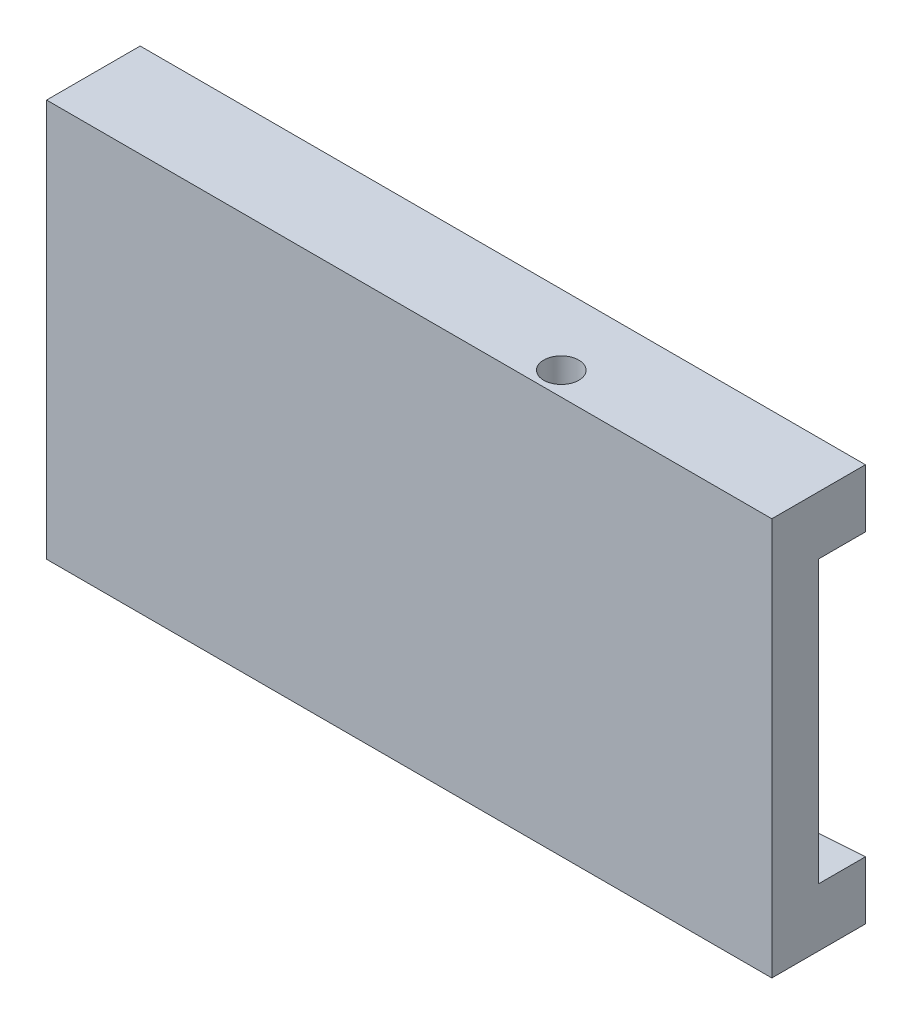
ISO-10303-21;
HEADER;
FILE_DESCRIPTION(('STEP AP214'),'2;1');
FILE_NAME('part.step','',(''),(''),'','','');
FILE_SCHEMA(('AUTOMOTIVE_DESIGN { 1 0 10303 214 1 1 1 1 }'));
ENDSEC;
DATA;
#1=APPLICATION_CONTEXT('core data for automotive mechanical design processes');
#2=APPLICATION_PROTOCOL_DEFINITION('international standard','automotive_design',2000,#1);
#3=PRODUCT_CONTEXT('',#1,'mechanical');
#4=PRODUCT('Part','Part','',(#3));
#5=PRODUCT_RELATED_PRODUCT_CATEGORY('part','',(#4));
#6=PRODUCT_DEFINITION_FORMATION('','',#4);
#7=PRODUCT_DEFINITION_CONTEXT('part definition',#1,'design');
#8=PRODUCT_DEFINITION('design','',#6,#7);
#9=PRODUCT_DEFINITION_SHAPE('','',#8);
#10=(LENGTH_UNIT() NAMED_UNIT(*) SI_UNIT(.MILLI.,.METRE.));
#11=(NAMED_UNIT(*) PLANE_ANGLE_UNIT() SI_UNIT($,.RADIAN.));
#12=(NAMED_UNIT(*) SI_UNIT($,.STERADIAN.) SOLID_ANGLE_UNIT());
#13=UNCERTAINTY_MEASURE_WITH_UNIT(LENGTH_MEASURE(1.E-05),#10,'distance_accuracy_value','');
#14=(GEOMETRIC_REPRESENTATION_CONTEXT(3) GLOBAL_UNCERTAINTY_ASSIGNED_CONTEXT((#13)) GLOBAL_UNIT_ASSIGNED_CONTEXT((#10,
#11,#12)) REPRESENTATION_CONTEXT('',''));
#15=CARTESIAN_POINT('',(0.,0.,0.));
#16=DIRECTION('',(0.,0.,1.));
#17=DIRECTION('',(1.,0.,0.));
#18=AXIS2_PLACEMENT_3D('',#15,#16,#17);
#19=CARTESIAN_POINT('',(-20.,34.,-2.));
#20=DIRECTION('',(0.,0.,1.));
#21=DIRECTION('',(1.,0.,0.));
#22=AXIS2_PLACEMENT_3D('',#19,#20,#21);
#23=PLANE('',#22);
#24=DIRECTION('',(0.997950714144406,0.0639872810695241,0.));
#25=VECTOR('',#24,1.);
#26=CARTESIAN_POINT('',(20.,4.97535807137709,-2.));
#27=LINE('',#26,#25);
#28=CARTESIAN_POINT('',(-42.,0.999999999999999,-2.));
#29=VERTEX_POINT('',#28);
#30=CARTESIAN_POINT('',(20.,4.97535807137709,-2.));
#31=VERTEX_POINT('',#30);
#32=EDGE_CURVE('E120',#29,#31,#27,.T.);
#33=ORIENTED_EDGE('',*,*,#32,.F.);
#34=DIRECTION('',(0.,-1.,0.));
#35=VECTOR('',#34,1.);
#36=CARTESIAN_POINT('',(-42.,34.,-2.));
#37=LINE('',#36,#35);
#38=CARTESIAN_POINT('',(-42.,33.,-2.));
#39=VERTEX_POINT('',#38);
#40=EDGE_CURVE('E125',#39,#29,#37,.T.);
#41=ORIENTED_EDGE('',*,*,#40,.F.);
#42=DIRECTION('',(-0.997950714144406,0.0639872810695241,0.));
#43=VECTOR('',#42,1.);
#44=CARTESIAN_POINT('',(20.,29.0246419286229,-2.));
#45=LINE('',#44,#43);
#46=CARTESIAN_POINT('',(20.,29.0246419286229,-2.));
#47=VERTEX_POINT('',#46);
#48=EDGE_CURVE('E49',#47,#39,#45,.T.);
#49=ORIENTED_EDGE('',*,*,#48,.F.);
#50=DIRECTION('',(0.,-1.,0.));
#51=VECTOR('',#50,1.);
#52=CARTESIAN_POINT('',(20.,34.,-2.));
#53=LINE('',#52,#51);
#54=EDGE_CURVE('E11',#47,#31,#53,.T.);
#55=ORIENTED_EDGE('',*,*,#54,.T.);
#56=EDGE_LOOP('',(#33,#41,#49,#55));
#57=FACE_BOUND('',#56,.T.);
#58=ADVANCED_FACE('F35',(#57),#23,.F.);
#59=CARTESIAN_POINT('',(20.,34.,-2.));
#60=DIRECTION('',(-1.,0.,0.));
#61=DIRECTION('',(0.,0.,1.));
#62=AXIS2_PLACEMENT_3D('',#59,#60,#61);
#63=PLANE('',#62);
#64=DIRECTION('',(0.,0.,-1.));
#65=VECTOR('',#64,1.);
#66=CARTESIAN_POINT('',(20.,0.,-2.));
#67=LINE('',#66,#65);
#68=CARTESIAN_POINT('',(20.,0.,2.));
#69=VERTEX_POINT('',#68);
#70=CARTESIAN_POINT('',(20.,0.,-6.));
#71=VERTEX_POINT('',#70);
#72=EDGE_CURVE('E165',#69,#71,#67,.T.);
#73=ORIENTED_EDGE('',*,*,#72,.T.);
#74=DIRECTION('',(0.,-1.,0.));
#75=VECTOR('',#74,1.);
#76=CARTESIAN_POINT('',(20.,0.,-6.));
#77=LINE('',#76,#75);
#78=CARTESIAN_POINT('',(20.,4.97535807137709,-6.));
#79=VERTEX_POINT('',#78);
#80=EDGE_CURVE('E110',#79,#71,#77,.T.);
#81=ORIENTED_EDGE('',*,*,#80,.F.);
#82=DIRECTION('',(0.,0.,1.));
#83=VECTOR('',#82,1.);
#84=CARTESIAN_POINT('',(20.,4.97535807137709,-6.));
#85=LINE('',#84,#83);
#86=EDGE_CURVE('E106',#79,#31,#85,.T.);
#87=ORIENTED_EDGE('',*,*,#86,.T.);
#88=ORIENTED_EDGE('',*,*,#54,.F.);
#89=DIRECTION('',(0.,0.,1.));
#90=VECTOR('',#89,1.);
#91=CARTESIAN_POINT('',(20.,29.0246419286229,-6.));
#92=LINE('',#91,#90);
#93=CARTESIAN_POINT('',(20.,29.0246419286229,-6.));
#94=VERTEX_POINT('',#93);
#95=EDGE_CURVE('E144',#94,#47,#92,.T.);
#96=ORIENTED_EDGE('',*,*,#95,.F.);
#97=DIRECTION('',(0.,-1.,0.));
#98=VECTOR('',#97,1.);
#99=CARTESIAN_POINT('',(20.,34.,-6.));
#100=LINE('',#99,#98);
#101=CARTESIAN_POINT('',(20.,34.,-6.));
#102=VERTEX_POINT('',#101);
#103=EDGE_CURVE('E127',#102,#94,#100,.T.);
#104=ORIENTED_EDGE('',*,*,#103,.F.);
#105=DIRECTION('',(0.,0.,-1.));
#106=VECTOR('',#105,1.);
#107=CARTESIAN_POINT('',(20.,34.,-2.));
#108=LINE('',#107,#106);
#109=CARTESIAN_POINT('',(20.,34.,2.));
#110=VERTEX_POINT('',#109);
#111=EDGE_CURVE('E168',#110,#102,#108,.T.);
#112=ORIENTED_EDGE('',*,*,#111,.F.);
#113=DIRECTION('',(0.,-1.,0.));
#114=VECTOR('',#113,1.);
#115=CARTESIAN_POINT('',(20.,34.,2.));
#116=LINE('',#115,#114);
#117=EDGE_CURVE('E43',#110,#69,#116,.T.);
#118=ORIENTED_EDGE('',*,*,#117,.T.);
#119=EDGE_LOOP('',(#73,#81,#87,#88,#96,#104,#112,#118));
#120=FACE_BOUND('',#119,.T.);
#121=ADVANCED_FACE('F37',(#120),#63,.F.);
#122=CARTESIAN_POINT('',(-20.,34.,2.));
#123=DIRECTION('',(0.,0.,-1.));
#124=DIRECTION('',(-1.,0.,0.));
#125=AXIS2_PLACEMENT_3D('',#122,#123,#124);
#126=PLANE('',#125);
#127=DIRECTION('',(1.,0.,0.));
#128=VECTOR('',#127,1.);
#129=CARTESIAN_POINT('',(-20.,0.,2.));
#130=LINE('',#129,#128);
#131=CARTESIAN_POINT('',(-42.,0.,2.));
#132=VERTEX_POINT('',#131);
#133=EDGE_CURVE('E170',#132,#69,#130,.T.);
#134=ORIENTED_EDGE('',*,*,#133,.T.);
#135=ORIENTED_EDGE('',*,*,#117,.F.);
#136=DIRECTION('',(1.,0.,0.));
#137=VECTOR('',#136,1.);
#138=CARTESIAN_POINT('',(-20.,34.,2.));
#139=LINE('',#138,#137);
#140=CARTESIAN_POINT('',(-42.,34.,2.));
#141=VERTEX_POINT('',#140);
#142=EDGE_CURVE('E58',#141,#110,#139,.T.);
#143=ORIENTED_EDGE('',*,*,#142,.F.);
#144=DIRECTION('',(0.,1.,0.));
#145=VECTOR('',#144,1.);
#146=CARTESIAN_POINT('',(-42.,0.,2.));
#147=LINE('',#146,#145);
#148=EDGE_CURVE('E150',#132,#141,#147,.T.);
#149=ORIENTED_EDGE('',*,*,#148,.F.);
#150=EDGE_LOOP('',(#134,#135,#143,#149));
#151=FACE_BOUND('',#150,.T.);
#152=ADVANCED_FACE('F188',(#151),#126,.F.);
#153=CARTESIAN_POINT('',(0.,34.,0.));
#154=DIRECTION('',(0.,1.,0.));
#155=DIRECTION('',(0.,0.,1.));
#156=AXIS2_PLACEMENT_3D('',#153,#154,#155);
#157=PLANE('',#156);
#158=CARTESIAN_POINT('',(0.,34.,0.));
#159=DIRECTION('',(0.,-1.,0.));
#160=DIRECTION('',(0.,0.,-1.));
#161=AXIS2_PLACEMENT_3D('',#158,#159,#160);
#162=CIRCLE('',#161,1.5);
#163=CARTESIAN_POINT('',(0.,34.,-1.5));
#164=VERTEX_POINT('',#163);
#165=EDGE_CURVE('E155',#164,#164,#162,.T.);
#166=ORIENTED_EDGE('',*,*,#165,.T.);
#167=EDGE_LOOP('',(#166));
#168=FACE_BOUND('',#167,.T.);
#169=ORIENTED_EDGE('',*,*,#111,.T.);
#170=DIRECTION('',(1.,0.,0.));
#171=VECTOR('',#170,1.);
#172=CARTESIAN_POINT('',(-42.,34.,-6.));
#173=LINE('',#172,#171);
#174=CARTESIAN_POINT('',(-42.,34.,-6.));
#175=VERTEX_POINT('',#174);
#176=EDGE_CURVE('E139',#175,#102,#173,.T.);
#177=ORIENTED_EDGE('',*,*,#176,.F.);
#178=DIRECTION('',(0.,0.,-1.));
#179=VECTOR('',#178,1.);
#180=CARTESIAN_POINT('',(-42.,34.,2.));
#181=LINE('',#180,#179);
#182=EDGE_CURVE('E153',#141,#175,#181,.T.);
#183=ORIENTED_EDGE('',*,*,#182,.F.);
#184=ORIENTED_EDGE('',*,*,#142,.T.);
#185=EDGE_LOOP('',(#169,#177,#183,#184));
#186=FACE_BOUND('',#185,.T.);
#187=ADVANCED_FACE('F192',(#168,#186),#157,.T.);
#188=CARTESIAN_POINT('',(0.,0.,0.));
#189=DIRECTION('',(0.,1.,0.));
#190=DIRECTION('',(0.,0.,1.));
#191=AXIS2_PLACEMENT_3D('',#188,#189,#190);
#192=PLANE('',#191);
#193=CARTESIAN_POINT('',(0.,0.,0.));
#194=DIRECTION('',(0.,-1.,0.));
#195=DIRECTION('',(0.,0.,-1.));
#196=AXIS2_PLACEMENT_3D('',#193,#194,#195);
#197=CIRCLE('',#196,1.5);
#198=CARTESIAN_POINT('',(0.,0.,-1.5));
#199=VERTEX_POINT('',#198);
#200=EDGE_CURVE('E159',#199,#199,#197,.T.);
#201=ORIENTED_EDGE('',*,*,#200,.F.);
#202=EDGE_LOOP('',(#201));
#203=FACE_BOUND('',#202,.T.);
#204=ORIENTED_EDGE('',*,*,#72,.F.);
#205=ORIENTED_EDGE('',*,*,#133,.F.);
#206=DIRECTION('',(0.,0.,1.));
#207=VECTOR('',#206,1.);
#208=CARTESIAN_POINT('',(-42.,0.,-2.));
#209=LINE('',#208,#207);
#210=CARTESIAN_POINT('',(-42.,0.,-6.));
#211=VERTEX_POINT('',#210);
#212=EDGE_CURVE('E148',#211,#132,#209,.T.);
#213=ORIENTED_EDGE('',*,*,#212,.F.);
#214=DIRECTION('',(-1.,0.,0.));
#215=VECTOR('',#214,1.);
#216=CARTESIAN_POINT('',(-42.,0.,-6.));
#217=LINE('',#216,#215);
#218=EDGE_CURVE('E117',#71,#211,#217,.T.);
#219=ORIENTED_EDGE('',*,*,#218,.F.);
#220=EDGE_LOOP('',(#204,#205,#213,#219));
#221=FACE_BOUND('',#220,.T.);
#222=ADVANCED_FACE('F180',(#203,#221),#192,.F.);
#223=CARTESIAN_POINT('',(0.,6.,0.));
#224=DIRECTION('',(0.,-1.,0.));
#225=DIRECTION('',(0.,0.,-1.));
#226=AXIS2_PLACEMENT_3D('',#223,#224,#225);
#227=CYLINDRICAL_SURFACE('',#226,1.5);
#228=CARTESIAN_POINT('',(0.,6.,0.));
#229=DIRECTION('',(0.,-1.,0.));
#230=DIRECTION('',(0.,0.,-1.));
#231=AXIS2_PLACEMENT_3D('',#228,#229,#230);
#232=CIRCLE('',#231,1.5);
#233=CARTESIAN_POINT('',(0.,6.,-1.5));
#234=VERTEX_POINT('',#233);
#235=EDGE_CURVE('E162',#234,#234,#232,.T.);
#236=ORIENTED_EDGE('',*,*,#235,.F.);
#237=EDGE_LOOP('',(#236));
#238=FACE_BOUND('',#237,.T.);
#239=ORIENTED_EDGE('',*,*,#200,.T.);
#240=EDGE_LOOP('',(#239));
#241=FACE_BOUND('',#240,.T.);
#242=ADVANCED_FACE('F195',(#238,#241),#227,.F.);
#243=CARTESIAN_POINT('',(0.,6.,0.));
#244=DIRECTION('',(0.,-1.,0.));
#245=DIRECTION('',(0.,0.,-1.));
#246=AXIS2_PLACEMENT_3D('',#243,#244,#245);
#247=PLANE('',#246);
#248=ORIENTED_EDGE('',*,*,#235,.T.);
#249=EDGE_LOOP('',(#248));
#250=FACE_BOUND('',#249,.T.);
#251=ADVANCED_FACE('F202',(#250),#247,.T.);
#252=CARTESIAN_POINT('',(0.,28.,0.));
#253=DIRECTION('',(0.,1.,0.));
#254=DIRECTION('',(0.,0.,1.));
#255=AXIS2_PLACEMENT_3D('',#252,#253,#254);
#256=CYLINDRICAL_SURFACE('',#255,1.5);
#257=CARTESIAN_POINT('',(0.,28.,0.));
#258=DIRECTION('',(0.,-1.,0.));
#259=DIRECTION('',(0.,0.,-1.));
#260=AXIS2_PLACEMENT_3D('',#257,#258,#259);
#261=CIRCLE('',#260,1.5);
#262=CARTESIAN_POINT('',(0.,28.,-1.5));
#263=VERTEX_POINT('',#262);
#264=EDGE_CURVE('E156',#263,#263,#261,.T.);
#265=ORIENTED_EDGE('',*,*,#264,.T.);
#266=EDGE_LOOP('',(#265));
#267=FACE_BOUND('',#266,.T.);
#268=ORIENTED_EDGE('',*,*,#165,.F.);
#269=EDGE_LOOP('',(#268));
#270=FACE_BOUND('',#269,.T.);
#271=ADVANCED_FACE('F206',(#267,#270),#256,.F.);
#272=CARTESIAN_POINT('',(0.,28.,0.));
#273=DIRECTION('',(0.,1.,0.));
#274=DIRECTION('',(0.,0.,-1.));
#275=AXIS2_PLACEMENT_3D('',#272,#273,#274);
#276=PLANE('',#275);
#277=ORIENTED_EDGE('',*,*,#264,.F.);
#278=EDGE_LOOP('',(#277));
#279=FACE_BOUND('',#278,.T.);
#280=ADVANCED_FACE('F210',(#279),#276,.T.);
#281=CARTESIAN_POINT('',(-42.,0.,0.));
#282=DIRECTION('',(-1.,0.,0.));
#283=DIRECTION('',(0.,0.,1.));
#284=AXIS2_PLACEMENT_3D('',#281,#282,#283);
#285=PLANE('',#284);
#286=ORIENTED_EDGE('',*,*,#182,.T.);
#287=DIRECTION('',(0.,1.,0.));
#288=VECTOR('',#287,1.);
#289=CARTESIAN_POINT('',(-42.,33.,-6.));
#290=LINE('',#289,#288);
#291=CARTESIAN_POINT('',(-42.,33.,-6.));
#292=VERTEX_POINT('',#291);
#293=EDGE_CURVE('E136',#292,#175,#290,.T.);
#294=ORIENTED_EDGE('',*,*,#293,.F.);
#295=DIRECTION('',(0.,0.,1.));
#296=VECTOR('',#295,1.);
#297=CARTESIAN_POINT('',(-42.,33.,-6.));
#298=LINE('',#297,#296);
#299=EDGE_CURVE('E141',#292,#39,#298,.T.);
#300=ORIENTED_EDGE('',*,*,#299,.T.);
#301=ORIENTED_EDGE('',*,*,#40,.T.);
#302=DIRECTION('',(0.,0.,1.));
#303=VECTOR('',#302,1.);
#304=CARTESIAN_POINT('',(-42.,0.999999999999999,-6.));
#305=LINE('',#304,#303);
#306=CARTESIAN_POINT('',(-42.,0.999999999999999,-6.));
#307=VERTEX_POINT('',#306);
#308=EDGE_CURVE('E103',#307,#29,#305,.T.);
#309=ORIENTED_EDGE('',*,*,#308,.F.);
#310=DIRECTION('',(0.,1.,0.));
#311=VECTOR('',#310,1.);
#312=CARTESIAN_POINT('',(-42.,0.999999999999999,-6.));
#313=LINE('',#312,#311);
#314=EDGE_CURVE('E111',#211,#307,#313,.T.);
#315=ORIENTED_EDGE('',*,*,#314,.F.);
#316=ORIENTED_EDGE('',*,*,#212,.T.);
#317=ORIENTED_EDGE('',*,*,#148,.T.);
#318=EDGE_LOOP('',(#286,#294,#300,#301,#309,#315,#316,#317));
#319=FACE_BOUND('',#318,.T.);
#320=ADVANCED_FACE('F123',(#319),#285,.T.);
#321=CARTESIAN_POINT('',(20.,29.0246419286229,-6.));
#322=DIRECTION('',(0.0639872810695241,0.997950714144406,0.));
#323=DIRECTION('',(-0.997950714144406,0.0639872810695241,0.));
#324=AXIS2_PLACEMENT_3D('',#321,#322,#323);
#325=PLANE('',#324);
#326=ORIENTED_EDGE('',*,*,#48,.T.);
#327=ORIENTED_EDGE('',*,*,#299,.F.);
#328=DIRECTION('',(-0.997950714144406,0.0639872810695241,0.));
#329=VECTOR('',#328,1.);
#330=CARTESIAN_POINT('',(20.,29.0246419286229,-6.));
#331=LINE('',#330,#329);
#332=EDGE_CURVE('E134',#94,#292,#331,.T.);
#333=ORIENTED_EDGE('',*,*,#332,.F.);
#334=ORIENTED_EDGE('',*,*,#95,.T.);
#335=EDGE_LOOP('',(#326,#327,#333,#334));
#336=FACE_BOUND('',#335,.T.);
#337=ADVANCED_FACE('F217',(#336),#325,.F.);
#338=CARTESIAN_POINT('',(0.,0.,-6.));
#339=DIRECTION('',(0.,0.,1.));
#340=DIRECTION('',(1.,0.,0.));
#341=AXIS2_PLACEMENT_3D('',#338,#339,#340);
#342=PLANE('',#341);
#343=ORIENTED_EDGE('',*,*,#103,.T.);
#344=ORIENTED_EDGE('',*,*,#332,.T.);
#345=ORIENTED_EDGE('',*,*,#293,.T.);
#346=ORIENTED_EDGE('',*,*,#176,.T.);
#347=EDGE_LOOP('',(#343,#344,#345,#346));
#348=FACE_BOUND('',#347,.T.);
#349=ADVANCED_FACE('F220',(#348),#342,.F.);
#350=CARTESIAN_POINT('',(20.,4.97535807137709,-6.));
#351=DIRECTION('',(0.0639872810695242,-0.997950714144406,0.));
#352=DIRECTION('',(0.997950714144406,0.0639872810695242,0.));
#353=AXIS2_PLACEMENT_3D('',#350,#351,#352);
#354=PLANE('',#353);
#355=ORIENTED_EDGE('',*,*,#32,.T.);
#356=ORIENTED_EDGE('',*,*,#86,.F.);
#357=DIRECTION('',(0.997950714144406,0.0639872810695241,0.));
#358=VECTOR('',#357,1.);
#359=CARTESIAN_POINT('',(20.,4.97535807137709,-6.));
#360=LINE('',#359,#358);
#361=EDGE_CURVE('E99',#307,#79,#360,.T.);
#362=ORIENTED_EDGE('',*,*,#361,.F.);
#363=ORIENTED_EDGE('',*,*,#308,.T.);
#364=EDGE_LOOP('',(#355,#356,#362,#363));
#365=FACE_BOUND('',#364,.T.);
#366=ADVANCED_FACE('F101',(#365),#354,.F.);
#367=CARTESIAN_POINT('',(0.,0.,-6.));
#368=DIRECTION('',(0.,0.,1.));
#369=DIRECTION('',(1.,0.,0.));
#370=AXIS2_PLACEMENT_3D('',#367,#368,#369);
#371=PLANE('',#370);
#372=ORIENTED_EDGE('',*,*,#314,.T.);
#373=ORIENTED_EDGE('',*,*,#361,.T.);
#374=ORIENTED_EDGE('',*,*,#80,.T.);
#375=ORIENTED_EDGE('',*,*,#218,.T.);
#376=EDGE_LOOP('',(#372,#373,#374,#375));
#377=FACE_BOUND('',#376,.T.);
#378=ADVANCED_FACE('F115',(#377),#371,.F.);
#379=CLOSED_SHELL('',(#58,#121,#152,#187,#222,#242,#251,#271,#280,#320,#337,#349,#366,#378));
#380=MANIFOLD_SOLID_BREP('B2',#379);
#381=ADVANCED_BREP_SHAPE_REPRESENTATION('',(#18,#380),#14);
#382=SHAPE_DEFINITION_REPRESENTATION(#9,#381);
ENDSEC;
END-ISO-10303-21;
